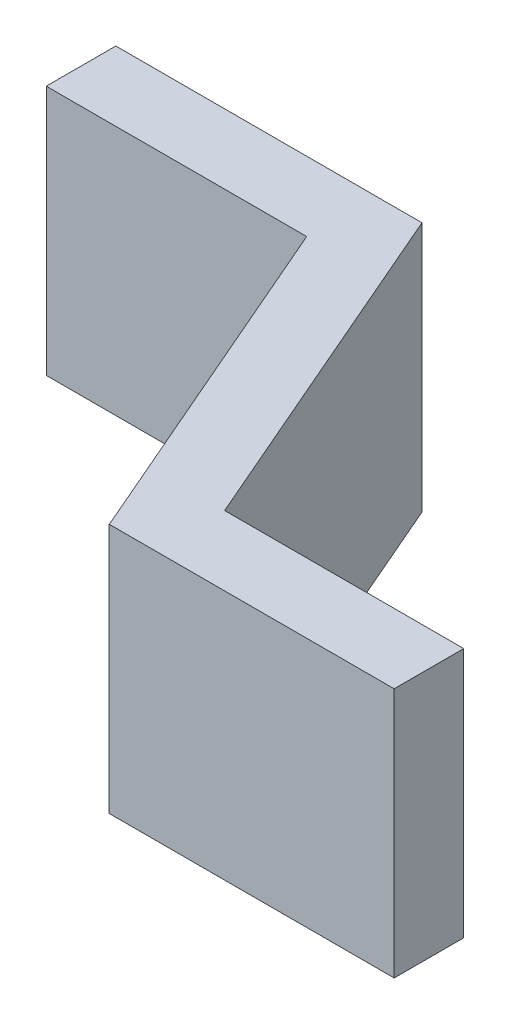
ISO-10303-21;
HEADER;
FILE_DESCRIPTION(('STEP AP214'),'2;1');
FILE_NAME('part.step','',(''),(''),'','','');
FILE_SCHEMA(('AUTOMOTIVE_DESIGN { 1 0 10303 214 1 1 1 1 }'));
ENDSEC;
DATA;
#1=APPLICATION_CONTEXT('core data for automotive mechanical design processes');
#2=APPLICATION_PROTOCOL_DEFINITION('international standard','automotive_design',2000,#1);
#3=PRODUCT_CONTEXT('',#1,'mechanical');
#4=PRODUCT('Part','Part','',(#3));
#5=PRODUCT_RELATED_PRODUCT_CATEGORY('part','',(#4));
#6=PRODUCT_DEFINITION_FORMATION('','',#4);
#7=PRODUCT_DEFINITION_CONTEXT('part definition',#1,'design');
#8=PRODUCT_DEFINITION('design','',#6,#7);
#9=PRODUCT_DEFINITION_SHAPE('','',#8);
#10=(LENGTH_UNIT() NAMED_UNIT(*) SI_UNIT(.MILLI.,.METRE.));
#11=(NAMED_UNIT(*) PLANE_ANGLE_UNIT() SI_UNIT($,.RADIAN.));
#12=(NAMED_UNIT(*) SI_UNIT($,.STERADIAN.) SOLID_ANGLE_UNIT());
#13=UNCERTAINTY_MEASURE_WITH_UNIT(LENGTH_MEASURE(1.E-05),#10,'distance_accuracy_value','');
#14=(GEOMETRIC_REPRESENTATION_CONTEXT(3) GLOBAL_UNCERTAINTY_ASSIGNED_CONTEXT((#13)) GLOBAL_UNIT_ASSIGNED_CONTEXT((#10,
#11,#12)) REPRESENTATION_CONTEXT('',''));
#15=CARTESIAN_POINT('',(0.,0.,0.));
#16=DIRECTION('',(0.,0.,1.));
#17=DIRECTION('',(1.,0.,0.));
#18=AXIS2_PLACEMENT_3D('',#15,#16,#17);
#19=CARTESIAN_POINT('',(0.,8.22,0.));
#20=DIRECTION('',(1.,0.,0.));
#21=DIRECTION('',(0.,0.,-1.));
#22=AXIS2_PLACEMENT_3D('',#19,#20,#21);
#23=PLANE('',#22);
#24=DIRECTION('',(0.,1.,0.));
#25=VECTOR('',#24,1.);
#26=CARTESIAN_POINT('',(0.,8.22,0.));
#27=LINE('',#26,#25);
#28=CARTESIAN_POINT('',(0.,8.580000014305,-1.30339419427667E-10));
#29=VERTEX_POINT('',#28);
#30=CARTESIAN_POINT('',(0.,8.22,-1.556831963824E-10));
#31=VERTEX_POINT('',#30);
#32=EDGE_CURVE('E123',#29,#31,#27,.F.);
#33=ORIENTED_EDGE('',*,*,#32,.T.);
#34=DIRECTION('',(0.,0.,1.));
#35=VECTOR('',#34,1.);
#36=CARTESIAN_POINT('',(0.,8.22,0.));
#37=LINE('',#36,#35);
#38=CARTESIAN_POINT('',(0.,8.22,0.10000000149));
#39=VERTEX_POINT('',#38);
#40=EDGE_CURVE('E115',#31,#39,#37,.T.);
#41=ORIENTED_EDGE('',*,*,#40,.T.);
#42=DIRECTION('',(0.,1.,0.));
#43=VECTOR('',#42,1.);
#44=CARTESIAN_POINT('',(0.,8.22,0.10000000149));
#45=LINE('',#44,#43);
#46=CARTESIAN_POINT('',(0.,8.580000014305,0.10000000149));
#47=VERTEX_POINT('',#46);
#48=EDGE_CURVE('E134',#47,#39,#45,.F.);
#49=ORIENTED_EDGE('',*,*,#48,.F.);
#50=DIRECTION('',(0.,0.,1.));
#51=VECTOR('',#50,1.);
#52=CARTESIAN_POINT('',(0.,8.580000014305,0.));
#53=LINE('',#52,#51);
#54=EDGE_CURVE('E140',#29,#47,#53,.T.);
#55=ORIENTED_EDGE('',*,*,#54,.F.);
#56=EDGE_LOOP('',(#33,#41,#49,#55));
#57=FACE_BOUND('',#56,.T.);
#58=ADVANCED_FACE('F17',(#57),#23,.F.);
#59=CARTESIAN_POINT('',(0.,8.22,0.10000000149));
#60=DIRECTION('',(0.,0.,1.));
#61=DIRECTION('',(1.,0.,0.));
#62=AXIS2_PLACEMENT_3D('',#59,#60,#61);
#63=PLANE('',#62);
#64=DIRECTION('',(0.,1.,0.));
#65=VECTOR('',#64,1.);
#66=CARTESIAN_POINT('',(0.374312226605181,8.22,0.100000001489922));
#67=LINE('',#66,#65);
#68=CARTESIAN_POINT('',(0.37431222660506,8.580000014305,0.100000001489974));
#69=VERTEX_POINT('',#68);
#70=CARTESIAN_POINT('',(0.374312226605091,8.22,0.100000001489974));
#71=VERTEX_POINT('',#70);
#72=EDGE_CURVE('E132',#69,#71,#67,.F.);
#73=ORIENTED_EDGE('',*,*,#72,.F.);
#74=DIRECTION('',(1.,0.,0.));
#75=VECTOR('',#74,1.);
#76=CARTESIAN_POINT('',(0.44,8.580000014305,0.10000000149));
#77=LINE('',#76,#75);
#78=EDGE_CURVE('E137',#47,#69,#77,.T.);
#79=ORIENTED_EDGE('',*,*,#78,.F.);
#80=ORIENTED_EDGE('',*,*,#48,.T.);
#81=DIRECTION('',(1.,0.,0.));
#82=VECTOR('',#81,1.);
#83=CARTESIAN_POINT('',(0.44,8.22,0.10000000149));
#84=LINE('',#83,#82);
#85=EDGE_CURVE('E111',#39,#71,#84,.T.);
#86=ORIENTED_EDGE('',*,*,#85,.T.);
#87=EDGE_LOOP('',(#73,#79,#80,#86));
#88=FACE_BOUND('',#87,.T.);
#89=ADVANCED_FACE('F214',(#88),#63,.T.);
#90=CARTESIAN_POINT('',(0.348224508223,8.22,0.03971472531736));
#91=DIRECTION('',(-0.917754904098641,0.,0.397147247255844));
#92=DIRECTION('',(0.397147247255844,0.,0.917754904098641));
#93=AXIS2_PLACEMENT_3D('',#90,#91,#92);
#94=PLANE('',#93);
#95=DIRECTION('',(0.397147247255413,0.,0.917754904098827));
#96=VECTOR('',#95,1.);
#97=CARTESIAN_POINT('',(0.374312226605,8.22,0.10000000149));
#98=LINE('',#97,#96);
#99=CARTESIAN_POINT('',(0.59,8.22,0.59842599627));
#100=VERTEX_POINT('',#99);
#101=EDGE_CURVE('E110',#71,#100,#98,.T.);
#102=ORIENTED_EDGE('',*,*,#101,.T.);
#103=DIRECTION('',(0.,1.,0.));
#104=VECTOR('',#103,1.);
#105=CARTESIAN_POINT('',(0.59,8.22,0.59842599627));
#106=LINE('',#105,#104);
#107=CARTESIAN_POINT('',(0.59,8.580000014305,0.59842599627));
#108=VERTEX_POINT('',#107);
#109=EDGE_CURVE('E86',#100,#108,#106,.T.);
#110=ORIENTED_EDGE('',*,*,#109,.T.);
#111=DIRECTION('',(0.397147247255413,0.,0.917754904098827));
#112=VECTOR('',#111,1.);
#113=CARTESIAN_POINT('',(0.374312226605,8.580000014305,0.10000000149));
#114=LINE('',#113,#112);
#115=EDGE_CURVE('E139',#69,#108,#114,.T.);
#116=ORIENTED_EDGE('',*,*,#115,.F.);
#117=ORIENTED_EDGE('',*,*,#72,.T.);
#118=EDGE_LOOP('',(#102,#110,#116,#117));
#119=FACE_BOUND('',#118,.T.);
#120=ADVANCED_FACE('F215',(#119),#94,.T.);
#121=CARTESIAN_POINT('',(0.59,8.22,0.5));
#122=DIRECTION('',(1.,0.,0.));
#123=DIRECTION('',(0.,0.,-1.));
#124=AXIS2_PLACEMENT_3D('',#121,#122,#123);
#125=PLANE('',#124);
#126=ORIENTED_EDGE('',*,*,#109,.F.);
#127=DIRECTION('',(0.,0.,-1.));
#128=VECTOR('',#127,1.);
#129=CARTESIAN_POINT('',(0.59,8.22,0.5));
#130=LINE('',#129,#128);
#131=CARTESIAN_POINT('',(0.59,8.22,0.60000000149));
#132=VERTEX_POINT('',#131);
#133=EDGE_CURVE('E20',#100,#132,#130,.F.);
#134=ORIENTED_EDGE('',*,*,#133,.T.);
#135=DIRECTION('',(0.,1.,0.));
#136=VECTOR('',#135,1.);
#137=CARTESIAN_POINT('',(0.59,8.22,0.60000000149));
#138=LINE('',#137,#136);
#139=CARTESIAN_POINT('',(0.59,8.580000014305,0.60000000149));
#140=VERTEX_POINT('',#139);
#141=EDGE_CURVE('E93',#140,#132,#138,.F.);
#142=ORIENTED_EDGE('',*,*,#141,.F.);
#143=DIRECTION('',(0.,0.,1.));
#144=VECTOR('',#143,1.);
#145=CARTESIAN_POINT('',(0.59,8.580000014305,0.));
#146=LINE('',#145,#144);
#147=EDGE_CURVE('E182',#108,#140,#146,.T.);
#148=ORIENTED_EDGE('',*,*,#147,.F.);
#149=EDGE_LOOP('',(#126,#134,#142,#148));
#150=FACE_BOUND('',#149,.T.);
#151=ADVANCED_FACE('F109',(#150),#125,.F.);
#152=CARTESIAN_POINT('',(0.59,8.22,0.60000000149));
#153=DIRECTION('',(0.,0.,1.));
#154=DIRECTION('',(1.,0.,0.));
#155=AXIS2_PLACEMENT_3D('',#152,#153,#154);
#156=PLANE('',#155);
#157=ORIENTED_EDGE('',*,*,#141,.T.);
#158=DIRECTION('',(1.,0.,0.));
#159=VECTOR('',#158,1.);
#160=CARTESIAN_POINT('',(0.44,8.22,0.60000000149));
#161=LINE('',#160,#159);
#162=CARTESIAN_POINT('',(0.999999996424,8.22,0.60000000149));
#163=VERTEX_POINT('',#162);
#164=EDGE_CURVE('E97',#132,#163,#161,.T.);
#165=ORIENTED_EDGE('',*,*,#164,.T.);
#166=DIRECTION('',(0.,1.,0.));
#167=VECTOR('',#166,1.);
#168=CARTESIAN_POINT('',(0.999999996424,8.22,0.60000000149));
#169=LINE('',#168,#167);
#170=CARTESIAN_POINT('',(0.999999996424,8.580000014305,0.60000000149));
#171=VERTEX_POINT('',#170);
#172=EDGE_CURVE('E99',#171,#163,#169,.F.);
#173=ORIENTED_EDGE('',*,*,#172,.F.);
#174=DIRECTION('',(1.,0.,0.));
#175=VECTOR('',#174,1.);
#176=CARTESIAN_POINT('',(0.44,8.580000014305,0.60000000149));
#177=LINE('',#176,#175);
#178=EDGE_CURVE('E98',#140,#171,#177,.T.);
#179=ORIENTED_EDGE('',*,*,#178,.F.);
#180=EDGE_LOOP('',(#157,#165,#173,#179));
#181=FACE_BOUND('',#180,.T.);
#182=ADVANCED_FACE('F95',(#181),#156,.T.);
#183=CARTESIAN_POINT('',(0.999999996424,8.22,0.5));
#184=DIRECTION('',(1.,0.,0.));
#185=DIRECTION('',(0.,0.,-1.));
#186=AXIS2_PLACEMENT_3D('',#183,#184,#185);
#187=PLANE('',#186);
#188=DIRECTION('',(0.,0.,1.));
#189=VECTOR('',#188,1.);
#190=CARTESIAN_POINT('',(0.999999996424,8.22,0.));
#191=LINE('',#190,#189);
#192=CARTESIAN_POINT('',(0.999999996424,8.22,0.5));
#193=VERTEX_POINT('',#192);
#194=EDGE_CURVE('E107',#163,#193,#191,.F.);
#195=ORIENTED_EDGE('',*,*,#194,.T.);
#196=DIRECTION('',(0.,1.,0.));
#197=VECTOR('',#196,1.);
#198=CARTESIAN_POINT('',(0.999999996424,8.22,0.5));
#199=LINE('',#198,#197);
#200=CARTESIAN_POINT('',(0.999999996424,8.580000014305,0.5));
#201=VERTEX_POINT('',#200);
#202=EDGE_CURVE('E192',#193,#201,#199,.T.);
#203=ORIENTED_EDGE('',*,*,#202,.T.);
#204=DIRECTION('',(0.,0.,1.));
#205=VECTOR('',#204,1.);
#206=CARTESIAN_POINT('',(0.999999996424,8.580000014305,0.));
#207=LINE('',#206,#205);
#208=EDGE_CURVE('E126',#171,#201,#207,.F.);
#209=ORIENTED_EDGE('',*,*,#208,.F.);
#210=ORIENTED_EDGE('',*,*,#172,.T.);
#211=EDGE_LOOP('',(#195,#203,#209,#210));
#212=FACE_BOUND('',#211,.T.);
#213=ADVANCED_FACE('F238',(#212),#187,.T.);
#214=CARTESIAN_POINT('',(0.,8.22,0.));
#215=DIRECTION('',(0.,0.,1.));
#216=DIRECTION('',(1.,0.,0.));
#217=AXIS2_PLACEMENT_3D('',#214,#215,#216);
#218=PLANE('',#217);
#219=DIRECTION('',(1.,0.,0.));
#220=VECTOR('',#219,1.);
#221=CARTESIAN_POINT('',(0.44,8.22,-2.335247945736E-10));
#222=LINE('',#221,#220);
#223=CARTESIAN_POINT('',(0.439999999656335,8.22,-3.43069646239979E-10));
#224=VERTEX_POINT('',#223);
#225=EDGE_CURVE('E155',#224,#31,#222,.F.);
#226=ORIENTED_EDGE('',*,*,#225,.T.);
#227=ORIENTED_EDGE('',*,*,#32,.F.);
#228=DIRECTION('',(1.,0.,0.));
#229=VECTOR('',#228,1.);
#230=CARTESIAN_POINT('',(0.44,8.580000014305,-1.955091291415E-10));
#231=LINE('',#230,#229);
#232=CARTESIAN_POINT('',(0.439999999458534,8.580000014305,-1.955091291415E-10));
#233=VERTEX_POINT('',#232);
#234=EDGE_CURVE('E147',#233,#29,#231,.F.);
#235=ORIENTED_EDGE('',*,*,#234,.F.);
#236=DIRECTION('',(0.,1.,0.));
#237=VECTOR('',#236,1.);
#238=CARTESIAN_POINT('',(0.439999999804137,8.22,-4.52614497906357E-10));
#239=LINE('',#238,#237);
#240=EDGE_CURVE('E128',#233,#224,#239,.F.);
#241=ORIENTED_EDGE('',*,*,#240,.T.);
#242=EDGE_LOOP('',(#226,#227,#235,#241));
#243=FACE_BOUND('',#242,.T.);
#244=ADVANCED_FACE('F235',(#243),#218,.F.);
#245=CARTESIAN_POINT('',(0.44,8.22,0.));
#246=DIRECTION('',(0.,1.,0.));
#247=DIRECTION('',(0.,0.,1.));
#248=AXIS2_PLACEMENT_3D('',#245,#246,#247);
#249=PLANE('',#248);
#250=DIRECTION('',(1.,0.,0.));
#251=VECTOR('',#250,1.);
#252=CARTESIAN_POINT('',(0.59,8.22,0.5));
#253=LINE('',#252,#251);
#254=CARTESIAN_POINT('',(0.656368904967001,8.22,0.499999999999999));
#255=VERTEX_POINT('',#254);
#256=EDGE_CURVE('E166',#255,#193,#253,.T.);
#257=ORIENTED_EDGE('',*,*,#256,.T.);
#258=ORIENTED_EDGE('',*,*,#194,.F.);
#259=ORIENTED_EDGE('',*,*,#164,.F.);
#260=ORIENTED_EDGE('',*,*,#133,.F.);
#261=ORIENTED_EDGE('',*,*,#101,.F.);
#262=ORIENTED_EDGE('',*,*,#85,.F.);
#263=ORIENTED_EDGE('',*,*,#40,.F.);
#264=ORIENTED_EDGE('',*,*,#225,.F.);
#265=DIRECTION('',(0.397147247255844,0.,0.917754904098641));
#266=VECTOR('',#265,1.);
#267=CARTESIAN_POINT('',(0.44,8.22,0.));
#268=LINE('',#267,#266);
#269=EDGE_CURVE('E160',#224,#255,#268,.T.);
#270=ORIENTED_EDGE('',*,*,#269,.T.);
#271=EDGE_LOOP('',(#257,#258,#259,#260,#261,#262,#263,#264,#270));
#272=FACE_BOUND('',#271,.T.);
#273=ADVANCED_FACE('F104',(#272),#249,.F.);
#274=CARTESIAN_POINT('',(0.59,8.22,0.5));
#275=DIRECTION('',(0.,0.,1.));
#276=DIRECTION('',(1.,0.,0.));
#277=AXIS2_PLACEMENT_3D('',#274,#275,#276);
#278=PLANE('',#277);
#279=ORIENTED_EDGE('',*,*,#256,.F.);
#280=DIRECTION('',(0.,1.,0.));
#281=VECTOR('',#280,1.);
#282=CARTESIAN_POINT('',(0.656368904967005,8.22,0.499999999999998));
#283=LINE('',#282,#281);
#284=CARTESIAN_POINT('',(0.656368904967001,8.580000014305,0.499999999999999));
#285=VERTEX_POINT('',#284);
#286=EDGE_CURVE('E26',#255,#285,#283,.T.);
#287=ORIENTED_EDGE('',*,*,#286,.T.);
#288=DIRECTION('',(1.,0.,0.));
#289=VECTOR('',#288,1.);
#290=CARTESIAN_POINT('',(0.44,8.580000014305,0.5));
#291=LINE('',#290,#289);
#292=EDGE_CURVE('E34',#201,#285,#291,.F.);
#293=ORIENTED_EDGE('',*,*,#292,.F.);
#294=ORIENTED_EDGE('',*,*,#202,.F.);
#295=EDGE_LOOP('',(#279,#287,#293,#294));
#296=FACE_BOUND('',#295,.T.);
#297=ADVANCED_FACE('F199',(#296),#278,.F.);
#298=CARTESIAN_POINT('',(0.44,8.580000014305,0.));
#299=DIRECTION('',(0.,1.,0.));
#300=DIRECTION('',(0.,0.,1.));
#301=AXIS2_PLACEMENT_3D('',#298,#299,#300);
#302=PLANE('',#301);
#303=ORIENTED_EDGE('',*,*,#178,.T.);
#304=ORIENTED_EDGE('',*,*,#208,.T.);
#305=ORIENTED_EDGE('',*,*,#292,.T.);
#306=DIRECTION('',(0.397147247255844,0.,0.917754904098641));
#307=VECTOR('',#306,1.);
#308=CARTESIAN_POINT('',(0.44,8.580000014305,0.));
#309=LINE('',#308,#307);
#310=EDGE_CURVE('E11',#285,#233,#309,.F.);
#311=ORIENTED_EDGE('',*,*,#310,.T.);
#312=ORIENTED_EDGE('',*,*,#234,.T.);
#313=ORIENTED_EDGE('',*,*,#54,.T.);
#314=ORIENTED_EDGE('',*,*,#78,.T.);
#315=ORIENTED_EDGE('',*,*,#115,.T.);
#316=ORIENTED_EDGE('',*,*,#147,.T.);
#317=EDGE_LOOP('',(#303,#304,#305,#311,#312,#313,#314,#315,#316));
#318=FACE_BOUND('',#317,.T.);
#319=ADVANCED_FACE('F204',(#318),#302,.T.);
#320=CARTESIAN_POINT('',(0.44,8.22,0.));
#321=DIRECTION('',(-0.917754904098641,0.,0.397147247255844));
#322=DIRECTION('',(0.397147247255844,0.,0.917754904098641));
#323=AXIS2_PLACEMENT_3D('',#320,#321,#322);
#324=PLANE('',#323);
#325=ORIENTED_EDGE('',*,*,#286,.F.);
#326=ORIENTED_EDGE('',*,*,#269,.F.);
#327=ORIENTED_EDGE('',*,*,#240,.F.);
#328=ORIENTED_EDGE('',*,*,#310,.F.);
#329=EDGE_LOOP('',(#325,#326,#327,#328));
#330=FACE_BOUND('',#329,.T.);
#331=ADVANCED_FACE('F201',(#330),#324,.F.);
#332=CLOSED_SHELL('',(#58,#89,#120,#151,#182,#213,#244,#273,#297,#319,#331));
#333=MANIFOLD_SOLID_BREP('B1',#332);
#334=ADVANCED_BREP_SHAPE_REPRESENTATION('',(#18,#333),#14);
#335=SHAPE_DEFINITION_REPRESENTATION(#9,#334);
ENDSEC;
END-ISO-10303-21;
